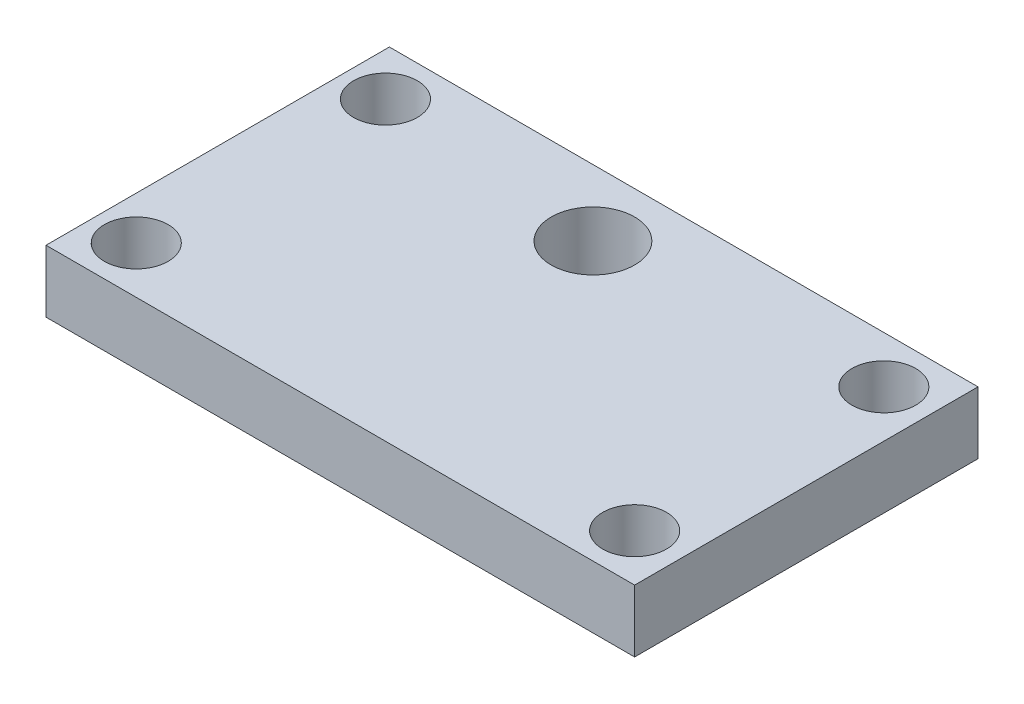
ISO-10303-21;
HEADER;
FILE_DESCRIPTION(('STEP AP214'),'2;1');
FILE_NAME('part.step','',(''),(''),'','','');
FILE_SCHEMA(('AUTOMOTIVE_DESIGN { 1 0 10303 214 1 1 1 1 }'));
ENDSEC;
DATA;
#1=APPLICATION_CONTEXT('core data for automotive mechanical design processes');
#2=APPLICATION_PROTOCOL_DEFINITION('international standard','automotive_design',2000,#1);
#3=PRODUCT_CONTEXT('',#1,'mechanical');
#4=PRODUCT('Part','Part','',(#3));
#5=PRODUCT_RELATED_PRODUCT_CATEGORY('part','',(#4));
#6=PRODUCT_DEFINITION_FORMATION('','',#4);
#7=PRODUCT_DEFINITION_CONTEXT('part definition',#1,'design');
#8=PRODUCT_DEFINITION('design','',#6,#7);
#9=PRODUCT_DEFINITION_SHAPE('','',#8);
#10=(LENGTH_UNIT() NAMED_UNIT(*) SI_UNIT(.MILLI.,.METRE.));
#11=(NAMED_UNIT(*) PLANE_ANGLE_UNIT() SI_UNIT($,.RADIAN.));
#12=(NAMED_UNIT(*) SI_UNIT($,.STERADIAN.) SOLID_ANGLE_UNIT());
#13=UNCERTAINTY_MEASURE_WITH_UNIT(LENGTH_MEASURE(1.E-05),#10,'distance_accuracy_value','');
#14=(GEOMETRIC_REPRESENTATION_CONTEXT(3) GLOBAL_UNCERTAINTY_ASSIGNED_CONTEXT((#13)) GLOBAL_UNIT_ASSIGNED_CONTEXT((#10,
#11,#12)) REPRESENTATION_CONTEXT('',''));
#15=CARTESIAN_POINT('',(0.,0.,0.));
#16=DIRECTION('',(0.,0.,1.));
#17=DIRECTION('',(1.,0.,0.));
#18=AXIS2_PLACEMENT_3D('',#15,#16,#17);
#19=CARTESIAN_POINT('',(0.,6.35,0.));
#20=DIRECTION('',(0.,-1.,0.));
#21=DIRECTION('',(0.,0.,-1.));
#22=AXIS2_PLACEMENT_3D('',#19,#20,#21);
#23=PLANE('',#22);
#24=CARTESIAN_POINT('',(-2.5,6.35,-10.75));
#25=DIRECTION('',(0.,1.,0.));
#26=DIRECTION('',(0.,0.,1.));
#27=AXIS2_PLACEMENT_3D('',#24,#25,#26);
#28=CIRCLE('',#27,4.25);
#29=CARTESIAN_POINT('',(-2.5,6.35,-6.5));
#30=VERTEX_POINT('',#29);
#31=EDGE_CURVE('E144',#30,#30,#28,.T.);
#32=ORIENTED_EDGE('',*,*,#31,.F.);
#33=EDGE_LOOP('',(#32));
#34=FACE_BOUND('',#33,.T.);
#35=DIRECTION('',(0.,0.,-1.));
#36=VECTOR('',#35,1.);
#37=CARTESIAN_POINT('',(30.,6.35,17.5));
#38=LINE('',#37,#36);
#39=CARTESIAN_POINT('',(30.,6.35,17.5));
#40=VERTEX_POINT('',#39);
#41=CARTESIAN_POINT('',(30.,6.35,-17.5));
#42=VERTEX_POINT('',#41);
#43=EDGE_CURVE('E93',#40,#42,#38,.T.);
#44=ORIENTED_EDGE('',*,*,#43,.T.);
#45=DIRECTION('',(-1.,0.,0.));
#46=VECTOR('',#45,1.);
#47=CARTESIAN_POINT('',(-30.,6.35,-17.5));
#48=LINE('',#47,#46);
#49=CARTESIAN_POINT('',(-30.,6.35,-17.5));
#50=VERTEX_POINT('',#49);
#51=EDGE_CURVE('E88',#42,#50,#48,.T.);
#52=ORIENTED_EDGE('',*,*,#51,.T.);
#53=DIRECTION('',(0.,0.,1.));
#54=VECTOR('',#53,1.);
#55=CARTESIAN_POINT('',(-30.,6.35,17.5));
#56=LINE('',#55,#54);
#57=CARTESIAN_POINT('',(-30.,6.35,17.5));
#58=VERTEX_POINT('',#57);
#59=EDGE_CURVE('E91',#50,#58,#56,.T.);
#60=ORIENTED_EDGE('',*,*,#59,.T.);
#61=DIRECTION('',(1.,0.,0.));
#62=VECTOR('',#61,1.);
#63=CARTESIAN_POINT('',(-30.,6.35,17.5));
#64=LINE('',#63,#62);
#65=EDGE_CURVE('E58',#58,#40,#64,.T.);
#66=ORIENTED_EDGE('',*,*,#65,.T.);
#67=EDGE_LOOP('',(#44,#52,#60,#66));
#68=FACE_BOUND('',#67,.T.);
#69=CARTESIAN_POINT('',(-25.6,6.35,-12.7));
#70=DIRECTION('',(0.,1.,0.));
#71=DIRECTION('',(0.,0.,1.));
#72=AXIS2_PLACEMENT_3D('',#69,#70,#71);
#73=CIRCLE('',#72,3.25);
#74=CARTESIAN_POINT('',(-25.6,6.35,-9.45));
#75=VERTEX_POINT('',#74);
#76=EDGE_CURVE('E108',#75,#75,#73,.T.);
#77=ORIENTED_EDGE('',*,*,#76,.F.);
#78=EDGE_LOOP('',(#77));
#79=FACE_BOUND('',#78,.T.);
#80=CARTESIAN_POINT('',(25.2,6.35,-12.7));
#81=DIRECTION('',(0.,1.,0.));
#82=DIRECTION('',(0.,0.,1.));
#83=AXIS2_PLACEMENT_3D('',#80,#81,#82);
#84=CIRCLE('',#83,3.25);
#85=CARTESIAN_POINT('',(25.2,6.35,-9.45));
#86=VERTEX_POINT('',#85);
#87=EDGE_CURVE('E123',#86,#86,#84,.T.);
#88=ORIENTED_EDGE('',*,*,#87,.F.);
#89=EDGE_LOOP('',(#88));
#90=FACE_BOUND('',#89,.T.);
#91=CARTESIAN_POINT('',(25.2,6.35,12.7));
#92=DIRECTION('',(0.,1.,0.));
#93=DIRECTION('',(0.,0.,1.));
#94=AXIS2_PLACEMENT_3D('',#91,#92,#93);
#95=CIRCLE('',#94,3.25);
#96=CARTESIAN_POINT('',(25.2,6.35,15.95));
#97=VERTEX_POINT('',#96);
#98=EDGE_CURVE('E129',#97,#97,#95,.T.);
#99=ORIENTED_EDGE('',*,*,#98,.F.);
#100=EDGE_LOOP('',(#99));
#101=FACE_BOUND('',#100,.T.);
#102=CARTESIAN_POINT('',(-25.6,6.35,12.7));
#103=DIRECTION('',(0.,1.,0.));
#104=DIRECTION('',(0.,0.,1.));
#105=AXIS2_PLACEMENT_3D('',#102,#103,#104);
#106=CIRCLE('',#105,3.25);
#107=CARTESIAN_POINT('',(-25.6,6.35,15.95));
#108=VERTEX_POINT('',#107);
#109=EDGE_CURVE('E135',#108,#108,#106,.T.);
#110=ORIENTED_EDGE('',*,*,#109,.F.);
#111=EDGE_LOOP('',(#110));
#112=FACE_BOUND('',#111,.T.);
#113=ADVANCED_FACE('F41',(#34,#68,#79,#90,#101,#112),#23,.F.);
#114=CARTESIAN_POINT('',(0.,0.,0.));
#115=DIRECTION('',(0.,-1.,0.));
#116=DIRECTION('',(0.,0.,-1.));
#117=AXIS2_PLACEMENT_3D('',#114,#115,#116);
#118=PLANE('',#117);
#119=CARTESIAN_POINT('',(-2.5,0.,-10.75));
#120=DIRECTION('',(0.,1.,0.));
#121=DIRECTION('',(0.,0.,1.));
#122=AXIS2_PLACEMENT_3D('',#119,#120,#121);
#123=CIRCLE('',#122,4.25);
#124=CARTESIAN_POINT('',(-2.5,0.,-6.5));
#125=VERTEX_POINT('',#124);
#126=EDGE_CURVE('E141',#125,#125,#123,.T.);
#127=ORIENTED_EDGE('',*,*,#126,.T.);
#128=EDGE_LOOP('',(#127));
#129=FACE_BOUND('',#128,.T.);
#130=CARTESIAN_POINT('',(25.2,0.,12.7));
#131=DIRECTION('',(0.,1.,0.));
#132=DIRECTION('',(0.,0.,1.));
#133=AXIS2_PLACEMENT_3D('',#130,#131,#132);
#134=CIRCLE('',#133,3.25);
#135=CARTESIAN_POINT('',(25.2,0.,15.95));
#136=VERTEX_POINT('',#135);
#137=EDGE_CURVE('E132',#136,#136,#134,.T.);
#138=ORIENTED_EDGE('',*,*,#137,.T.);
#139=EDGE_LOOP('',(#138));
#140=FACE_BOUND('',#139,.T.);
#141=CARTESIAN_POINT('',(-25.6,0.,-12.7));
#142=DIRECTION('',(0.,1.,0.));
#143=DIRECTION('',(0.,0.,1.));
#144=AXIS2_PLACEMENT_3D('',#141,#142,#143);
#145=CIRCLE('',#144,3.25);
#146=CARTESIAN_POINT('',(-25.6,0.,-9.45));
#147=VERTEX_POINT('',#146);
#148=EDGE_CURVE('E120',#147,#147,#145,.T.);
#149=ORIENTED_EDGE('',*,*,#148,.T.);
#150=EDGE_LOOP('',(#149));
#151=FACE_BOUND('',#150,.T.);
#152=DIRECTION('',(0.,0.,-1.));
#153=VECTOR('',#152,1.);
#154=CARTESIAN_POINT('',(30.,0.,17.5));
#155=LINE('',#154,#153);
#156=CARTESIAN_POINT('',(30.,0.,17.5));
#157=VERTEX_POINT('',#156);
#158=CARTESIAN_POINT('',(30.,0.,-17.5));
#159=VERTEX_POINT('',#158);
#160=EDGE_CURVE('E105',#157,#159,#155,.T.);
#161=ORIENTED_EDGE('',*,*,#160,.F.);
#162=DIRECTION('',(1.,0.,0.));
#163=VECTOR('',#162,1.);
#164=CARTESIAN_POINT('',(-30.,0.,17.5));
#165=LINE('',#164,#163);
#166=CARTESIAN_POINT('',(-30.,0.,17.5));
#167=VERTEX_POINT('',#166);
#168=EDGE_CURVE('E81',#167,#157,#165,.T.);
#169=ORIENTED_EDGE('',*,*,#168,.F.);
#170=DIRECTION('',(0.,0.,1.));
#171=VECTOR('',#170,1.);
#172=CARTESIAN_POINT('',(-30.,0.,17.5));
#173=LINE('',#172,#171);
#174=CARTESIAN_POINT('',(-30.,0.,-17.5));
#175=VERTEX_POINT('',#174);
#176=EDGE_CURVE('E75',#175,#167,#173,.T.);
#177=ORIENTED_EDGE('',*,*,#176,.F.);
#178=DIRECTION('',(-1.,0.,0.));
#179=VECTOR('',#178,1.);
#180=CARTESIAN_POINT('',(-30.,0.,-17.5));
#181=LINE('',#180,#179);
#182=EDGE_CURVE('E97',#159,#175,#181,.T.);
#183=ORIENTED_EDGE('',*,*,#182,.F.);
#184=EDGE_LOOP('',(#161,#169,#177,#183));
#185=FACE_BOUND('',#184,.T.);
#186=CARTESIAN_POINT('',(25.2,0.,-12.7));
#187=DIRECTION('',(0.,1.,0.));
#188=DIRECTION('',(0.,0.,1.));
#189=AXIS2_PLACEMENT_3D('',#186,#187,#188);
#190=CIRCLE('',#189,3.25);
#191=CARTESIAN_POINT('',(25.2,0.,-9.45));
#192=VERTEX_POINT('',#191);
#193=EDGE_CURVE('E126',#192,#192,#190,.T.);
#194=ORIENTED_EDGE('',*,*,#193,.T.);
#195=EDGE_LOOP('',(#194));
#196=FACE_BOUND('',#195,.T.);
#197=CARTESIAN_POINT('',(-25.6,0.,12.7));
#198=DIRECTION('',(0.,1.,0.));
#199=DIRECTION('',(0.,0.,1.));
#200=AXIS2_PLACEMENT_3D('',#197,#198,#199);
#201=CIRCLE('',#200,3.25);
#202=CARTESIAN_POINT('',(-25.6,0.,15.95));
#203=VERTEX_POINT('',#202);
#204=EDGE_CURVE('E138',#203,#203,#201,.T.);
#205=ORIENTED_EDGE('',*,*,#204,.T.);
#206=EDGE_LOOP('',(#205));
#207=FACE_BOUND('',#206,.T.);
#208=ADVANCED_FACE('F116',(#129,#140,#151,#185,#196,#207),#118,.T.);
#209=CARTESIAN_POINT('',(30.,6.35,17.5));
#210=DIRECTION('',(-1.,0.,0.));
#211=DIRECTION('',(0.,0.,1.));
#212=AXIS2_PLACEMENT_3D('',#209,#210,#211);
#213=PLANE('',#212);
#214=ORIENTED_EDGE('',*,*,#160,.T.);
#215=DIRECTION('',(0.,-1.,0.));
#216=VECTOR('',#215,1.);
#217=CARTESIAN_POINT('',(30.,6.35,-17.5));
#218=LINE('',#217,#216);
#219=EDGE_CURVE('E11',#42,#159,#218,.T.);
#220=ORIENTED_EDGE('',*,*,#219,.F.);
#221=ORIENTED_EDGE('',*,*,#43,.F.);
#222=DIRECTION('',(0.,-1.,0.));
#223=VECTOR('',#222,1.);
#224=CARTESIAN_POINT('',(30.,6.35,17.5));
#225=LINE('',#224,#223);
#226=EDGE_CURVE('E101',#40,#157,#225,.T.);
#227=ORIENTED_EDGE('',*,*,#226,.T.);
#228=EDGE_LOOP('',(#214,#220,#221,#227));
#229=FACE_BOUND('',#228,.T.);
#230=ADVANCED_FACE('F43',(#229),#213,.F.);
#231=CARTESIAN_POINT('',(-30.,6.35,-17.5));
#232=DIRECTION('',(0.,0.,1.));
#233=DIRECTION('',(1.,0.,0.));
#234=AXIS2_PLACEMENT_3D('',#231,#232,#233);
#235=PLANE('',#234);
#236=ORIENTED_EDGE('',*,*,#182,.T.);
#237=DIRECTION('',(0.,-1.,0.));
#238=VECTOR('',#237,1.);
#239=CARTESIAN_POINT('',(-30.,6.35,-17.5));
#240=LINE('',#239,#238);
#241=EDGE_CURVE('E50',#50,#175,#240,.T.);
#242=ORIENTED_EDGE('',*,*,#241,.F.);
#243=ORIENTED_EDGE('',*,*,#51,.F.);
#244=ORIENTED_EDGE('',*,*,#219,.T.);
#245=EDGE_LOOP('',(#236,#242,#243,#244));
#246=FACE_BOUND('',#245,.T.);
#247=ADVANCED_FACE('F96',(#246),#235,.F.);
#248=CARTESIAN_POINT('',(-30.,6.35,17.5));
#249=DIRECTION('',(1.,0.,0.));
#250=DIRECTION('',(0.,0.,-1.));
#251=AXIS2_PLACEMENT_3D('',#248,#249,#250);
#252=PLANE('',#251);
#253=ORIENTED_EDGE('',*,*,#176,.T.);
#254=DIRECTION('',(0.,-1.,0.));
#255=VECTOR('',#254,1.);
#256=CARTESIAN_POINT('',(-30.,6.35,17.5));
#257=LINE('',#256,#255);
#258=EDGE_CURVE('E98',#58,#167,#257,.T.);
#259=ORIENTED_EDGE('',*,*,#258,.F.);
#260=ORIENTED_EDGE('',*,*,#59,.F.);
#261=ORIENTED_EDGE('',*,*,#241,.T.);
#262=EDGE_LOOP('',(#253,#259,#260,#261));
#263=FACE_BOUND('',#262,.T.);
#264=ADVANCED_FACE('F99',(#263),#252,.F.);
#265=CARTESIAN_POINT('',(-30.,6.35,17.5));
#266=DIRECTION('',(0.,0.,-1.));
#267=DIRECTION('',(-1.,0.,0.));
#268=AXIS2_PLACEMENT_3D('',#265,#266,#267);
#269=PLANE('',#268);
#270=ORIENTED_EDGE('',*,*,#168,.T.);
#271=ORIENTED_EDGE('',*,*,#226,.F.);
#272=ORIENTED_EDGE('',*,*,#65,.F.);
#273=ORIENTED_EDGE('',*,*,#258,.T.);
#274=EDGE_LOOP('',(#270,#271,#272,#273));
#275=FACE_BOUND('',#274,.T.);
#276=ADVANCED_FACE('F113',(#275),#269,.F.);
#277=CARTESIAN_POINT('',(-25.6,6.35,-12.7));
#278=DIRECTION('',(0.,-1.,0.));
#279=DIRECTION('',(0.,0.,-1.));
#280=AXIS2_PLACEMENT_3D('',#277,#278,#279);
#281=CYLINDRICAL_SURFACE('',#280,3.25);
#282=ORIENTED_EDGE('',*,*,#76,.T.);
#283=EDGE_LOOP('',(#282));
#284=FACE_BOUND('',#283,.T.);
#285=ORIENTED_EDGE('',*,*,#148,.F.);
#286=EDGE_LOOP('',(#285));
#287=FACE_BOUND('',#286,.T.);
#288=ADVANCED_FACE('F166',(#284,#287),#281,.F.);
#289=CARTESIAN_POINT('',(25.2,6.35,-12.7));
#290=DIRECTION('',(0.,-1.,0.));
#291=DIRECTION('',(0.,0.,-1.));
#292=AXIS2_PLACEMENT_3D('',#289,#290,#291);
#293=CYLINDRICAL_SURFACE('',#292,3.25);
#294=ORIENTED_EDGE('',*,*,#87,.T.);
#295=EDGE_LOOP('',(#294));
#296=FACE_BOUND('',#295,.T.);
#297=ORIENTED_EDGE('',*,*,#193,.F.);
#298=EDGE_LOOP('',(#297));
#299=FACE_BOUND('',#298,.T.);
#300=ADVANCED_FACE('F208',(#296,#299),#293,.F.);
#301=CARTESIAN_POINT('',(25.2,6.35,12.7));
#302=DIRECTION('',(0.,-1.,0.));
#303=DIRECTION('',(0.,0.,-1.));
#304=AXIS2_PLACEMENT_3D('',#301,#302,#303);
#305=CYLINDRICAL_SURFACE('',#304,3.25);
#306=ORIENTED_EDGE('',*,*,#98,.T.);
#307=EDGE_LOOP('',(#306));
#308=FACE_BOUND('',#307,.T.);
#309=ORIENTED_EDGE('',*,*,#137,.F.);
#310=EDGE_LOOP('',(#309));
#311=FACE_BOUND('',#310,.T.);
#312=ADVANCED_FACE('F201',(#308,#311),#305,.F.);
#313=CARTESIAN_POINT('',(-25.6,6.35,12.7));
#314=DIRECTION('',(0.,-1.,0.));
#315=DIRECTION('',(0.,0.,-1.));
#316=AXIS2_PLACEMENT_3D('',#313,#314,#315);
#317=CYLINDRICAL_SURFACE('',#316,3.25);
#318=ORIENTED_EDGE('',*,*,#109,.T.);
#319=EDGE_LOOP('',(#318));
#320=FACE_BOUND('',#319,.T.);
#321=ORIENTED_EDGE('',*,*,#204,.F.);
#322=EDGE_LOOP('',(#321));
#323=FACE_BOUND('',#322,.T.);
#324=ADVANCED_FACE('F155',(#320,#323),#317,.F.);
#325=CARTESIAN_POINT('',(-2.5,0.,-10.75));
#326=DIRECTION('',(0.,1.,0.));
#327=DIRECTION('',(0.,0.,1.));
#328=AXIS2_PLACEMENT_3D('',#325,#326,#327);
#329=CYLINDRICAL_SURFACE('',#328,4.25);
#330=ORIENTED_EDGE('',*,*,#126,.F.);
#331=EDGE_LOOP('',(#330));
#332=FACE_BOUND('',#331,.T.);
#333=ORIENTED_EDGE('',*,*,#31,.T.);
#334=EDGE_LOOP('',(#333));
#335=FACE_BOUND('',#334,.T.);
#336=ADVANCED_FACE('F152',(#332,#335),#329,.F.);
#337=CLOSED_SHELL('',(#113,#208,#230,#247,#264,#276,#288,#300,#312,#324,#336));
#338=MANIFOLD_SOLID_BREP('B2',#337);
#339=ADVANCED_BREP_SHAPE_REPRESENTATION('',(#18,#338),#14);
#340=SHAPE_DEFINITION_REPRESENTATION(#9,#339);
ENDSEC;
END-ISO-10303-21;
